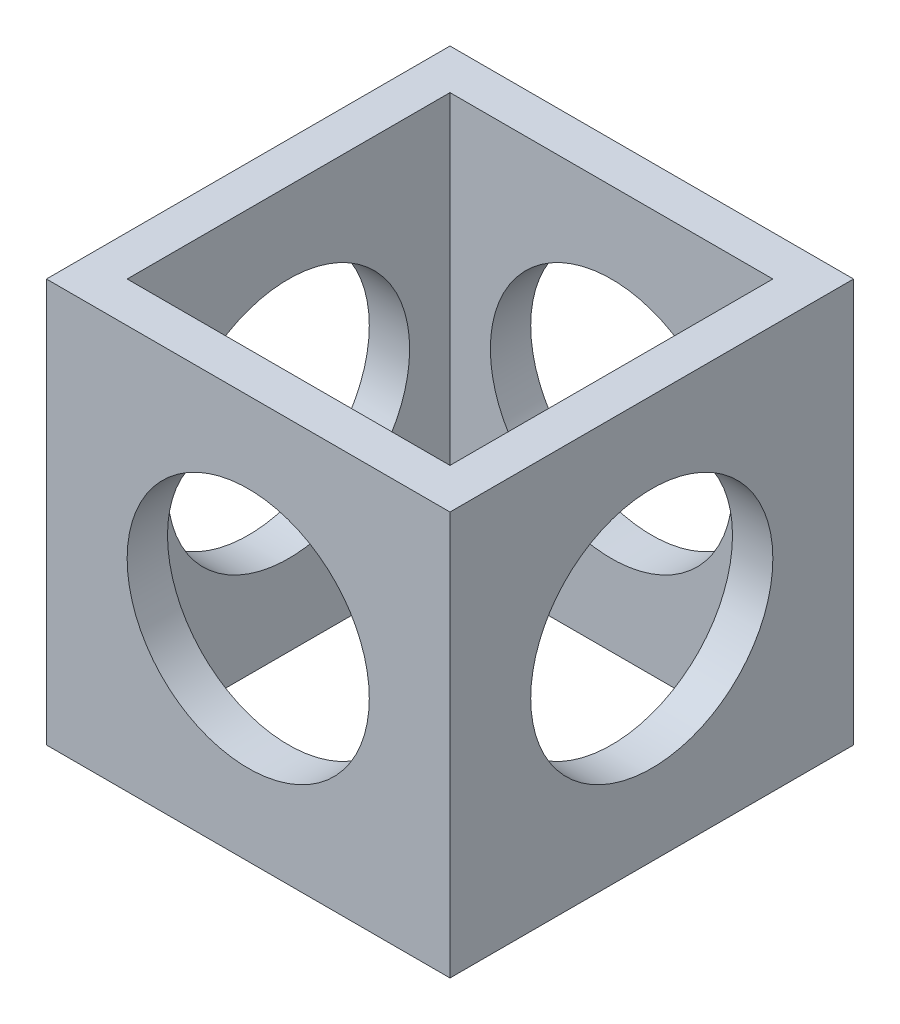
ISO-10303-21;
HEADER;
FILE_DESCRIPTION(('STEP AP214'),'2;1');
FILE_NAME('part.step','',(''),(''),'','','');
FILE_SCHEMA(('AUTOMOTIVE_DESIGN { 1 0 10303 214 1 1 1 1 }'));
ENDSEC;
DATA;
#1=APPLICATION_CONTEXT('core data for automotive mechanical design processes');
#2=APPLICATION_PROTOCOL_DEFINITION('international standard','automotive_design',2000,#1);
#3=PRODUCT_CONTEXT('',#1,'mechanical');
#4=PRODUCT('Part','Part','',(#3));
#5=PRODUCT_RELATED_PRODUCT_CATEGORY('part','',(#4));
#6=PRODUCT_DEFINITION_FORMATION('','',#4);
#7=PRODUCT_DEFINITION_CONTEXT('part definition',#1,'design');
#8=PRODUCT_DEFINITION('design','',#6,#7);
#9=PRODUCT_DEFINITION_SHAPE('','',#8);
#10=(LENGTH_UNIT() NAMED_UNIT(*) SI_UNIT(.MILLI.,.METRE.));
#11=(NAMED_UNIT(*) PLANE_ANGLE_UNIT() SI_UNIT($,.RADIAN.));
#12=(NAMED_UNIT(*) SI_UNIT($,.STERADIAN.) SOLID_ANGLE_UNIT());
#13=UNCERTAINTY_MEASURE_WITH_UNIT(LENGTH_MEASURE(1.E-05),#10,'distance_accuracy_value','');
#14=(GEOMETRIC_REPRESENTATION_CONTEXT(3) GLOBAL_UNCERTAINTY_ASSIGNED_CONTEXT((#13)) GLOBAL_UNIT_ASSIGNED_CONTEXT((#10,
#11,#12)) REPRESENTATION_CONTEXT('',''));
#15=CARTESIAN_POINT('',(0.,0.,0.));
#16=DIRECTION('',(0.,0.,1.));
#17=DIRECTION('',(1.,0.,0.));
#18=AXIS2_PLACEMENT_3D('',#15,#16,#17);
#19=CARTESIAN_POINT('',(0.,50.,0.));
#20=DIRECTION('',(0.,1.,0.));
#21=DIRECTION('',(0.,0.,1.));
#22=AXIS2_PLACEMENT_3D('',#19,#20,#21);
#23=PLANE('',#22);
#24=DIRECTION('',(0.,0.,-1.));
#25=VECTOR('',#24,1.);
#26=CARTESIAN_POINT('',(25.,50.,-25.));
#27=LINE('',#26,#25);
#28=CARTESIAN_POINT('',(25.,50.,25.));
#29=VERTEX_POINT('',#28);
#30=CARTESIAN_POINT('',(25.,50.,-25.));
#31=VERTEX_POINT('',#30);
#32=EDGE_CURVE('E157',#29,#31,#27,.T.);
#33=ORIENTED_EDGE('',*,*,#32,.T.);
#34=DIRECTION('',(-1.,0.,0.));
#35=VECTOR('',#34,1.);
#36=CARTESIAN_POINT('',(-25.,50.,-25.));
#37=LINE('',#36,#35);
#38=CARTESIAN_POINT('',(-25.,50.,-25.));
#39=VERTEX_POINT('',#38);
#40=EDGE_CURVE('E161',#31,#39,#37,.T.);
#41=ORIENTED_EDGE('',*,*,#40,.T.);
#42=DIRECTION('',(0.,0.,1.));
#43=VECTOR('',#42,1.);
#44=CARTESIAN_POINT('',(-25.,50.,-25.));
#45=LINE('',#44,#43);
#46=CARTESIAN_POINT('',(-25.,50.,25.));
#47=VERTEX_POINT('',#46);
#48=EDGE_CURVE('E165',#39,#47,#45,.T.);
#49=ORIENTED_EDGE('',*,*,#48,.T.);
#50=DIRECTION('',(1.,0.,0.));
#51=VECTOR('',#50,1.);
#52=CARTESIAN_POINT('',(-25.,50.,25.));
#53=LINE('',#52,#51);
#54=EDGE_CURVE('E168',#47,#29,#53,.T.);
#55=ORIENTED_EDGE('',*,*,#54,.T.);
#56=EDGE_LOOP('',(#33,#41,#49,#55));
#57=FACE_BOUND('',#56,.T.);
#58=DIRECTION('',(0.,0.,1.));
#59=VECTOR('',#58,1.);
#60=CARTESIAN_POINT('',(-20.,50.,-20.));
#61=LINE('',#60,#59);
#62=CARTESIAN_POINT('',(-20.,50.,-20.));
#63=VERTEX_POINT('',#62);
#64=CARTESIAN_POINT('',(-20.,50.,20.));
#65=VERTEX_POINT('',#64);
#66=EDGE_CURVE('E116',#63,#65,#61,.T.);
#67=ORIENTED_EDGE('',*,*,#66,.F.);
#68=DIRECTION('',(-1.,0.,0.));
#69=VECTOR('',#68,1.);
#70=CARTESIAN_POINT('',(-20.,50.,-20.));
#71=LINE('',#70,#69);
#72=CARTESIAN_POINT('',(20.,50.,-20.));
#73=VERTEX_POINT('',#72);
#74=EDGE_CURVE('E107',#73,#63,#71,.T.);
#75=ORIENTED_EDGE('',*,*,#74,.F.);
#76=DIRECTION('',(0.,0.,-1.));
#77=VECTOR('',#76,1.);
#78=CARTESIAN_POINT('',(20.,50.,-20.));
#79=LINE('',#78,#77);
#80=CARTESIAN_POINT('',(20.,50.,20.));
#81=VERTEX_POINT('',#80);
#82=EDGE_CURVE('E133',#81,#73,#79,.T.);
#83=ORIENTED_EDGE('',*,*,#82,.F.);
#84=DIRECTION('',(1.,0.,0.));
#85=VECTOR('',#84,1.);
#86=CARTESIAN_POINT('',(-20.,50.,20.));
#87=LINE('',#86,#85);
#88=EDGE_CURVE('E129',#65,#81,#87,.T.);
#89=ORIENTED_EDGE('',*,*,#88,.F.);
#90=EDGE_LOOP('',(#67,#75,#83,#89));
#91=FACE_BOUND('',#90,.T.);
#92=ADVANCED_FACE('F39',(#57,#91),#23,.T.);
#93=CARTESIAN_POINT('',(0.,0.,0.));
#94=DIRECTION('',(0.,1.,0.));
#95=DIRECTION('',(0.,0.,1.));
#96=AXIS2_PLACEMENT_3D('',#93,#94,#95);
#97=PLANE('',#96);
#98=DIRECTION('',(0.,0.,-1.));
#99=VECTOR('',#98,1.);
#100=CARTESIAN_POINT('',(25.,0.,-25.));
#101=LINE('',#100,#99);
#102=CARTESIAN_POINT('',(25.,0.,25.));
#103=VERTEX_POINT('',#102);
#104=CARTESIAN_POINT('',(25.,0.,-25.));
#105=VERTEX_POINT('',#104);
#106=EDGE_CURVE('E125',#103,#105,#101,.T.);
#107=ORIENTED_EDGE('',*,*,#106,.F.);
#108=DIRECTION('',(1.,0.,0.));
#109=VECTOR('',#108,1.);
#110=CARTESIAN_POINT('',(-25.,0.,25.));
#111=LINE('',#110,#109);
#112=CARTESIAN_POINT('',(-25.,0.,25.));
#113=VERTEX_POINT('',#112);
#114=EDGE_CURVE('E162',#113,#103,#111,.T.);
#115=ORIENTED_EDGE('',*,*,#114,.F.);
#116=DIRECTION('',(0.,0.,1.));
#117=VECTOR('',#116,1.);
#118=CARTESIAN_POINT('',(-25.,0.,-25.));
#119=LINE('',#118,#117);
#120=CARTESIAN_POINT('',(-25.,0.,-25.));
#121=VERTEX_POINT('',#120);
#122=EDGE_CURVE('E178',#121,#113,#119,.T.);
#123=ORIENTED_EDGE('',*,*,#122,.F.);
#124=DIRECTION('',(-1.,0.,0.));
#125=VECTOR('',#124,1.);
#126=CARTESIAN_POINT('',(-25.,0.,-25.));
#127=LINE('',#126,#125);
#128=EDGE_CURVE('E175',#105,#121,#127,.T.);
#129=ORIENTED_EDGE('',*,*,#128,.F.);
#130=EDGE_LOOP('',(#107,#115,#123,#129));
#131=FACE_BOUND('',#130,.T.);
#132=DIRECTION('',(-1.,0.,0.));
#133=VECTOR('',#132,1.);
#134=CARTESIAN_POINT('',(-20.,0.,-20.));
#135=LINE('',#134,#133);
#136=CARTESIAN_POINT('',(20.,0.,-20.));
#137=VERTEX_POINT('',#136);
#138=CARTESIAN_POINT('',(-20.,0.,-20.));
#139=VERTEX_POINT('',#138);
#140=EDGE_CURVE('E65',#137,#139,#135,.T.);
#141=ORIENTED_EDGE('',*,*,#140,.T.);
#142=DIRECTION('',(0.,0.,1.));
#143=VECTOR('',#142,1.);
#144=CARTESIAN_POINT('',(-20.,0.,-20.));
#145=LINE('',#144,#143);
#146=CARTESIAN_POINT('',(-20.,0.,20.));
#147=VERTEX_POINT('',#146);
#148=EDGE_CURVE('E123',#139,#147,#145,.T.);
#149=ORIENTED_EDGE('',*,*,#148,.T.);
#150=DIRECTION('',(1.,0.,0.));
#151=VECTOR('',#150,1.);
#152=CARTESIAN_POINT('',(-20.,0.,20.));
#153=LINE('',#152,#151);
#154=CARTESIAN_POINT('',(20.,0.,20.));
#155=VERTEX_POINT('',#154);
#156=EDGE_CURVE('E144',#147,#155,#153,.T.);
#157=ORIENTED_EDGE('',*,*,#156,.T.);
#158=DIRECTION('',(0.,0.,-1.));
#159=VECTOR('',#158,1.);
#160=CARTESIAN_POINT('',(20.,0.,-20.));
#161=LINE('',#160,#159);
#162=EDGE_CURVE('E117',#155,#137,#161,.T.);
#163=ORIENTED_EDGE('',*,*,#162,.T.);
#164=EDGE_LOOP('',(#141,#149,#157,#163));
#165=FACE_BOUND('',#164,.T.);
#166=ADVANCED_FACE('F237',(#131,#165),#97,.F.);
#167=CARTESIAN_POINT('',(25.,50.,-25.));
#168=DIRECTION('',(-1.,0.,0.));
#169=DIRECTION('',(0.,0.,1.));
#170=AXIS2_PLACEMENT_3D('',#167,#168,#169);
#171=PLANE('',#170);
#172=CARTESIAN_POINT('',(25.,25.,0.));
#173=DIRECTION('',(1.,0.,0.));
#174=DIRECTION('',(0.,0.,-1.));
#175=AXIS2_PLACEMENT_3D('',#172,#173,#174);
#176=CIRCLE('',#175,15.);
#177=CARTESIAN_POINT('',(25.,25.,-15.));
#178=VERTEX_POINT('',#177);
#179=EDGE_CURVE('E202',#178,#178,#176,.T.);
#180=ORIENTED_EDGE('',*,*,#179,.F.);
#181=EDGE_LOOP('',(#180));
#182=FACE_BOUND('',#181,.T.);
#183=ORIENTED_EDGE('',*,*,#106,.T.);
#184=DIRECTION('',(0.,-1.,0.));
#185=VECTOR('',#184,1.);
#186=CARTESIAN_POINT('',(25.,50.,-25.));
#187=LINE('',#186,#185);
#188=EDGE_CURVE('E11',#31,#105,#187,.T.);
#189=ORIENTED_EDGE('',*,*,#188,.F.);
#190=ORIENTED_EDGE('',*,*,#32,.F.);
#191=DIRECTION('',(0.,-1.,0.));
#192=VECTOR('',#191,1.);
#193=CARTESIAN_POINT('',(25.,50.,25.));
#194=LINE('',#193,#192);
#195=EDGE_CURVE('E171',#29,#103,#194,.T.);
#196=ORIENTED_EDGE('',*,*,#195,.T.);
#197=EDGE_LOOP('',(#183,#189,#190,#196));
#198=FACE_BOUND('',#197,.T.);
#199=ADVANCED_FACE('F41',(#182,#198),#171,.F.);
#200=CARTESIAN_POINT('',(-25.,50.,-25.));
#201=DIRECTION('',(0.,0.,1.));
#202=DIRECTION('',(1.,0.,0.));
#203=AXIS2_PLACEMENT_3D('',#200,#201,#202);
#204=PLANE('',#203);
#205=CARTESIAN_POINT('',(0.,25.,-25.));
#206=DIRECTION('',(0.,0.,-1.));
#207=DIRECTION('',(-1.,0.,0.));
#208=AXIS2_PLACEMENT_3D('',#205,#206,#207);
#209=CIRCLE('',#208,15.);
#210=CARTESIAN_POINT('',(-15.,25.,-25.));
#211=VERTEX_POINT('',#210);
#212=EDGE_CURVE('E214',#211,#211,#209,.T.);
#213=ORIENTED_EDGE('',*,*,#212,.F.);
#214=EDGE_LOOP('',(#213));
#215=FACE_BOUND('',#214,.T.);
#216=ORIENTED_EDGE('',*,*,#128,.T.);
#217=DIRECTION('',(0.,-1.,0.));
#218=VECTOR('',#217,1.);
#219=CARTESIAN_POINT('',(-25.,50.,-25.));
#220=LINE('',#219,#218);
#221=EDGE_CURVE('E49',#39,#121,#220,.T.);
#222=ORIENTED_EDGE('',*,*,#221,.F.);
#223=ORIENTED_EDGE('',*,*,#40,.F.);
#224=ORIENTED_EDGE('',*,*,#188,.T.);
#225=EDGE_LOOP('',(#216,#222,#223,#224));
#226=FACE_BOUND('',#225,.T.);
#227=ADVANCED_FACE('F263',(#215,#226),#204,.F.);
#228=CARTESIAN_POINT('',(-25.,50.,-25.));
#229=DIRECTION('',(1.,0.,0.));
#230=DIRECTION('',(0.,0.,-1.));
#231=AXIS2_PLACEMENT_3D('',#228,#229,#230);
#232=PLANE('',#231);
#233=CARTESIAN_POINT('',(-25.,25.,0.));
#234=DIRECTION('',(1.,0.,0.));
#235=DIRECTION('',(0.,0.,-1.));
#236=AXIS2_PLACEMENT_3D('',#233,#234,#235);
#237=CIRCLE('',#236,15.);
#238=CARTESIAN_POINT('',(-25.,25.,-15.));
#239=VERTEX_POINT('',#238);
#240=EDGE_CURVE('E195',#239,#239,#237,.T.);
#241=ORIENTED_EDGE('',*,*,#240,.T.);
#242=EDGE_LOOP('',(#241));
#243=FACE_BOUND('',#242,.T.);
#244=ORIENTED_EDGE('',*,*,#122,.T.);
#245=DIRECTION('',(0.,-1.,0.));
#246=VECTOR('',#245,1.);
#247=CARTESIAN_POINT('',(-25.,50.,25.));
#248=LINE('',#247,#246);
#249=EDGE_CURVE('E186',#47,#113,#248,.T.);
#250=ORIENTED_EDGE('',*,*,#249,.F.);
#251=ORIENTED_EDGE('',*,*,#48,.F.);
#252=ORIENTED_EDGE('',*,*,#221,.T.);
#253=EDGE_LOOP('',(#244,#250,#251,#252));
#254=FACE_BOUND('',#253,.T.);
#255=ADVANCED_FACE('F261',(#243,#254),#232,.F.);
#256=CARTESIAN_POINT('',(-25.,50.,25.));
#257=DIRECTION('',(0.,0.,-1.));
#258=DIRECTION('',(-1.,0.,0.));
#259=AXIS2_PLACEMENT_3D('',#256,#257,#258);
#260=PLANE('',#259);
#261=CARTESIAN_POINT('',(0.,25.,25.));
#262=DIRECTION('',(0.,0.,-1.));
#263=DIRECTION('',(-1.,0.,0.));
#264=AXIS2_PLACEMENT_3D('',#261,#262,#263);
#265=CIRCLE('',#264,15.);
#266=CARTESIAN_POINT('',(-15.,25.,25.));
#267=VERTEX_POINT('',#266);
#268=EDGE_CURVE('E218',#267,#267,#265,.T.);
#269=ORIENTED_EDGE('',*,*,#268,.T.);
#270=EDGE_LOOP('',(#269));
#271=FACE_BOUND('',#270,.T.);
#272=ORIENTED_EDGE('',*,*,#114,.T.);
#273=ORIENTED_EDGE('',*,*,#195,.F.);
#274=ORIENTED_EDGE('',*,*,#54,.F.);
#275=ORIENTED_EDGE('',*,*,#249,.T.);
#276=EDGE_LOOP('',(#272,#273,#274,#275));
#277=FACE_BOUND('',#276,.T.);
#278=ADVANCED_FACE('F258',(#271,#277),#260,.F.);
#279=CARTESIAN_POINT('',(-20.,50.,-20.));
#280=DIRECTION('',(0.,0.,1.));
#281=DIRECTION('',(1.,0.,0.));
#282=AXIS2_PLACEMENT_3D('',#279,#280,#281);
#283=PLANE('',#282);
#284=CARTESIAN_POINT('',(0.,25.,-20.));
#285=DIRECTION('',(0.,0.,1.));
#286=DIRECTION('',(1.,0.,0.));
#287=AXIS2_PLACEMENT_3D('',#284,#285,#286);
#288=CIRCLE('',#287,15.);
#289=CARTESIAN_POINT('',(15.,25.,-20.));
#290=VERTEX_POINT('',#289);
#291=EDGE_CURVE('E208',#290,#290,#288,.T.);
#292=ORIENTED_EDGE('',*,*,#291,.F.);
#293=EDGE_LOOP('',(#292));
#294=FACE_BOUND('',#293,.T.);
#295=ORIENTED_EDGE('',*,*,#140,.F.);
#296=DIRECTION('',(0.,-1.,0.));
#297=VECTOR('',#296,1.);
#298=CARTESIAN_POINT('',(20.,50.,-20.));
#299=LINE('',#298,#297);
#300=EDGE_CURVE('E111',#73,#137,#299,.T.);
#301=ORIENTED_EDGE('',*,*,#300,.F.);
#302=ORIENTED_EDGE('',*,*,#74,.T.);
#303=DIRECTION('',(0.,-1.,0.));
#304=VECTOR('',#303,1.);
#305=CARTESIAN_POINT('',(-20.,50.,-20.));
#306=LINE('',#305,#304);
#307=EDGE_CURVE('E110',#63,#139,#306,.T.);
#308=ORIENTED_EDGE('',*,*,#307,.T.);
#309=EDGE_LOOP('',(#295,#301,#302,#308));
#310=FACE_BOUND('',#309,.T.);
#311=ADVANCED_FACE('F109',(#294,#310),#283,.T.);
#312=CARTESIAN_POINT('',(-20.,50.,-20.));
#313=DIRECTION('',(1.,0.,0.));
#314=DIRECTION('',(0.,0.,-1.));
#315=AXIS2_PLACEMENT_3D('',#312,#313,#314);
#316=PLANE('',#315);
#317=CARTESIAN_POINT('',(-20.,25.,0.));
#318=DIRECTION('',(1.,0.,0.));
#319=DIRECTION('',(0.,0.,-1.));
#320=AXIS2_PLACEMENT_3D('',#317,#318,#319);
#321=CIRCLE('',#320,15.);
#322=CARTESIAN_POINT('',(-20.,25.,-15.));
#323=VERTEX_POINT('',#322);
#324=EDGE_CURVE('E141',#323,#323,#321,.T.);
#325=ORIENTED_EDGE('',*,*,#324,.F.);
#326=EDGE_LOOP('',(#325));
#327=FACE_BOUND('',#326,.T.);
#328=ORIENTED_EDGE('',*,*,#148,.F.);
#329=ORIENTED_EDGE('',*,*,#307,.F.);
#330=ORIENTED_EDGE('',*,*,#66,.T.);
#331=DIRECTION('',(0.,-1.,0.));
#332=VECTOR('',#331,1.);
#333=CARTESIAN_POINT('',(-20.,50.,20.));
#334=LINE('',#333,#332);
#335=EDGE_CURVE('E126',#65,#147,#334,.T.);
#336=ORIENTED_EDGE('',*,*,#335,.T.);
#337=EDGE_LOOP('',(#328,#329,#330,#336));
#338=FACE_BOUND('',#337,.T.);
#339=ADVANCED_FACE('F120',(#327,#338),#316,.T.);
#340=CARTESIAN_POINT('',(-20.,50.,20.));
#341=DIRECTION('',(0.,0.,-1.));
#342=DIRECTION('',(-1.,0.,0.));
#343=AXIS2_PLACEMENT_3D('',#340,#341,#342);
#344=PLANE('',#343);
#345=CARTESIAN_POINT('',(0.,25.,20.));
#346=DIRECTION('',(0.,0.,-1.));
#347=DIRECTION('',(-1.,0.,0.));
#348=AXIS2_PLACEMENT_3D('',#345,#346,#347);
#349=CIRCLE('',#348,15.);
#350=CARTESIAN_POINT('',(-15.,25.,20.));
#351=VERTEX_POINT('',#350);
#352=EDGE_CURVE('E43',#351,#351,#349,.T.);
#353=ORIENTED_EDGE('',*,*,#352,.F.);
#354=EDGE_LOOP('',(#353));
#355=FACE_BOUND('',#354,.T.);
#356=ORIENTED_EDGE('',*,*,#156,.F.);
#357=ORIENTED_EDGE('',*,*,#335,.F.);
#358=ORIENTED_EDGE('',*,*,#88,.T.);
#359=DIRECTION('',(0.,-1.,0.));
#360=VECTOR('',#359,1.);
#361=CARTESIAN_POINT('',(20.,50.,20.));
#362=LINE('',#361,#360);
#363=EDGE_CURVE('E57',#81,#155,#362,.T.);
#364=ORIENTED_EDGE('',*,*,#363,.T.);
#365=EDGE_LOOP('',(#356,#357,#358,#364));
#366=FACE_BOUND('',#365,.T.);
#367=ADVANCED_FACE('F230',(#355,#366),#344,.T.);
#368=CARTESIAN_POINT('',(20.,50.,-20.));
#369=DIRECTION('',(-1.,0.,0.));
#370=DIRECTION('',(0.,0.,1.));
#371=AXIS2_PLACEMENT_3D('',#368,#369,#370);
#372=PLANE('',#371);
#373=CARTESIAN_POINT('',(20.,25.,0.));
#374=DIRECTION('',(-1.,0.,0.));
#375=DIRECTION('',(0.,0.,1.));
#376=AXIS2_PLACEMENT_3D('',#373,#374,#375);
#377=CIRCLE('',#376,15.);
#378=CARTESIAN_POINT('',(20.,25.,15.));
#379=VERTEX_POINT('',#378);
#380=EDGE_CURVE('E192',#379,#379,#377,.T.);
#381=ORIENTED_EDGE('',*,*,#380,.F.);
#382=EDGE_LOOP('',(#381));
#383=FACE_BOUND('',#382,.T.);
#384=ORIENTED_EDGE('',*,*,#162,.F.);
#385=ORIENTED_EDGE('',*,*,#363,.F.);
#386=ORIENTED_EDGE('',*,*,#82,.T.);
#387=ORIENTED_EDGE('',*,*,#300,.T.);
#388=EDGE_LOOP('',(#384,#385,#386,#387));
#389=FACE_BOUND('',#388,.T.);
#390=ADVANCED_FACE('F233',(#383,#389),#372,.T.);
#391=CARTESIAN_POINT('',(-25.,25.,0.));
#392=DIRECTION('',(1.,0.,0.));
#393=DIRECTION('',(0.,0.,-1.));
#394=AXIS2_PLACEMENT_3D('',#391,#392,#393);
#395=CYLINDRICAL_SURFACE('',#394,15.);
#396=ORIENTED_EDGE('',*,*,#380,.T.);
#397=EDGE_LOOP('',(#396));
#398=FACE_BOUND('',#397,.T.);
#399=ORIENTED_EDGE('',*,*,#179,.T.);
#400=EDGE_LOOP('',(#399));
#401=FACE_BOUND('',#400,.T.);
#402=ADVANCED_FACE('F239',(#398,#401),#395,.F.);
#403=ORIENTED_EDGE('',*,*,#324,.T.);
#404=EDGE_LOOP('',(#403));
#405=FACE_BOUND('',#404,.T.);
#406=ORIENTED_EDGE('',*,*,#240,.F.);
#407=EDGE_LOOP('',(#406));
#408=FACE_BOUND('',#407,.T.);
#409=ADVANCED_FACE('F245',(#405,#408),#395,.F.);
#410=CARTESIAN_POINT('',(0.,25.,25.));
#411=DIRECTION('',(0.,0.,-1.));
#412=DIRECTION('',(-1.,0.,0.));
#413=AXIS2_PLACEMENT_3D('',#410,#411,#412);
#414=CYLINDRICAL_SURFACE('',#413,15.);
#415=ORIENTED_EDGE('',*,*,#352,.T.);
#416=EDGE_LOOP('',(#415));
#417=FACE_BOUND('',#416,.T.);
#418=ORIENTED_EDGE('',*,*,#268,.F.);
#419=EDGE_LOOP('',(#418));
#420=FACE_BOUND('',#419,.T.);
#421=ADVANCED_FACE('F227',(#417,#420),#414,.F.);
#422=ORIENTED_EDGE('',*,*,#291,.T.);
#423=EDGE_LOOP('',(#422));
#424=FACE_BOUND('',#423,.T.);
#425=ORIENTED_EDGE('',*,*,#212,.T.);
#426=EDGE_LOOP('',(#425));
#427=FACE_BOUND('',#426,.T.);
#428=ADVANCED_FACE('F286',(#424,#427),#414,.F.);
#429=CLOSED_SHELL('',(#92,#166,#199,#227,#255,#278,#311,#339,#367,#390,#402,#409,#421,#428));
#430=MANIFOLD_SOLID_BREP('B2',#429);
#431=ADVANCED_BREP_SHAPE_REPRESENTATION('',(#18,#430),#14);
#432=SHAPE_DEFINITION_REPRESENTATION(#9,#431);
ENDSEC;
END-ISO-10303-21;
